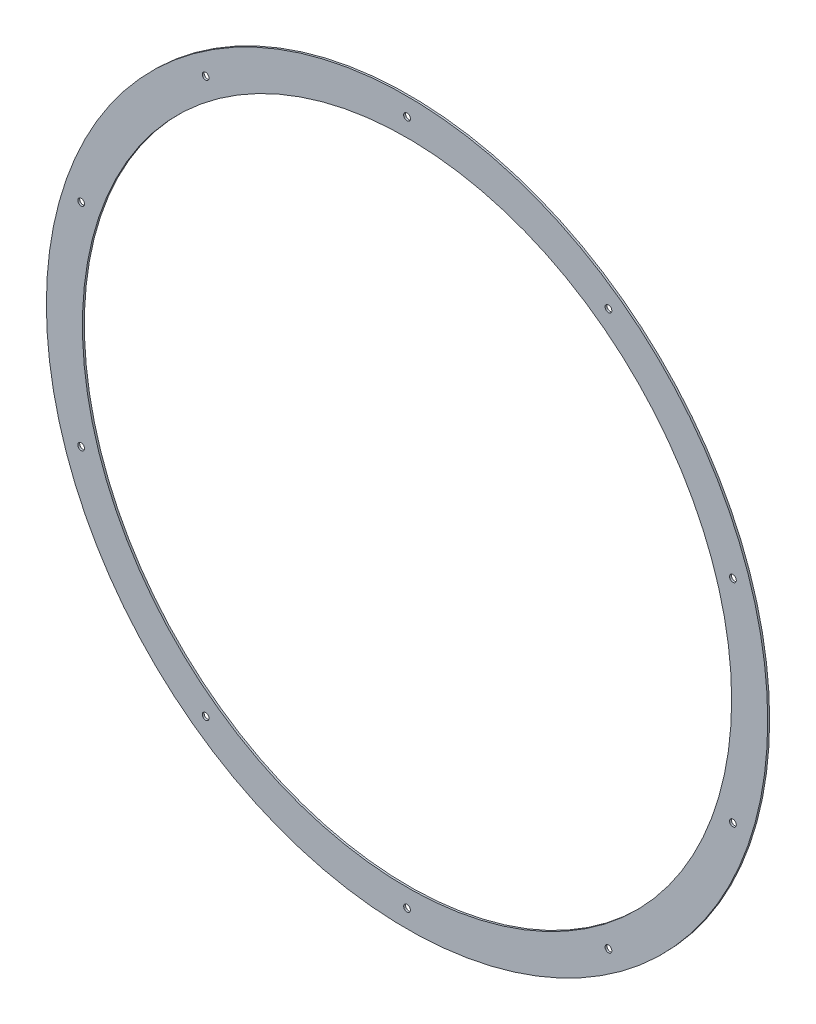
ISO-10303-21;
HEADER;
FILE_DESCRIPTION(('STEP AP214'),'2;1');
FILE_NAME('part.step','',(''),(''),'','','');
FILE_SCHEMA(('AUTOMOTIVE_DESIGN { 1 0 10303 214 1 1 1 1 }'));
ENDSEC;
DATA;
#1=APPLICATION_CONTEXT('core data for automotive mechanical design processes');
#2=APPLICATION_PROTOCOL_DEFINITION('international standard','automotive_design',2000,#1);
#3=PRODUCT_CONTEXT('',#1,'mechanical');
#4=PRODUCT('Part','Part','',(#3));
#5=PRODUCT_RELATED_PRODUCT_CATEGORY('part','',(#4));
#6=PRODUCT_DEFINITION_FORMATION('','',#4);
#7=PRODUCT_DEFINITION_CONTEXT('part definition',#1,'design');
#8=PRODUCT_DEFINITION('design','',#6,#7);
#9=PRODUCT_DEFINITION_SHAPE('','',#8);
#10=(LENGTH_UNIT() NAMED_UNIT(*) SI_UNIT(.MILLI.,.METRE.));
#11=(NAMED_UNIT(*) PLANE_ANGLE_UNIT() SI_UNIT($,.RADIAN.));
#12=(NAMED_UNIT(*) SI_UNIT($,.STERADIAN.) SOLID_ANGLE_UNIT());
#13=UNCERTAINTY_MEASURE_WITH_UNIT(LENGTH_MEASURE(1.E-05),#10,'distance_accuracy_value','');
#14=(GEOMETRIC_REPRESENTATION_CONTEXT(3) GLOBAL_UNCERTAINTY_ASSIGNED_CONTEXT((#13)) GLOBAL_UNIT_ASSIGNED_CONTEXT((#10,
#11,#12)) REPRESENTATION_CONTEXT('',''));
#15=CARTESIAN_POINT('',(0.,0.,0.));
#16=DIRECTION('',(0.,0.,1.));
#17=DIRECTION('',(1.,0.,0.));
#18=AXIS2_PLACEMENT_3D('',#15,#16,#17);
#19=CARTESIAN_POINT('',(0.,0.,2.032));
#20=DIRECTION('',(0.,0.,1.));
#21=DIRECTION('',(1.,0.,0.));
#22=AXIS2_PLACEMENT_3D('',#19,#20,#21);
#23=PLANE('',#22);
#24=CARTESIAN_POINT('',(-212.748872067257,-292.823701114015,2.032));
#25=DIRECTION('',(0.,0.,1.));
#26=DIRECTION('',(0.809016994374955,-0.587785252292462,0.));
#27=AXIS2_PLACEMENT_3D('',#24,#25,#26);
#28=CIRCLE('',#27,3.55599999999999);
#29=CARTESIAN_POINT('',(-209.872007635259,-294.913865471167,2.032));
#30=VERTEX_POINT('',#29);
#31=EDGE_CURVE('E106',#30,#30,#28,.T.);
#32=ORIENTED_EDGE('',*,*,#31,.F.);
#33=EDGE_LOOP('',(#32));
#34=FACE_BOUND('',#33,.T.);
#35=CARTESIAN_POINT('',(-344.23490607303,-111.848701114016,2.032));
#36=DIRECTION('',(0.,0.,1.));
#37=DIRECTION('',(0.309016994374958,-0.95105651629515,0.));
#38=AXIS2_PLACEMENT_3D('',#35,#36,#37);
#39=CIRCLE('',#38,3.55599999999999);
#40=CARTESIAN_POINT('',(-343.136041641032,-115.230658085962,2.032));
#41=VERTEX_POINT('',#40);
#42=EDGE_CURVE('E100',#41,#41,#39,.T.);
#43=ORIENTED_EDGE('',*,*,#42,.F.);
#44=EDGE_LOOP('',(#43));
#45=FACE_BOUND('',#44,.T.);
#46=CARTESIAN_POINT('',(-344.234906073032,111.848701114009,2.032));
#47=DIRECTION('',(0.,0.,1.));
#48=DIRECTION('',(-0.309016994374938,-0.951056516295157,0.));
#49=AXIS2_PLACEMENT_3D('',#46,#47,#48);
#50=CIRCLE('',#49,3.55599999999999);
#51=CARTESIAN_POINT('',(-345.333770505029,108.466744142063,2.032));
#52=VERTEX_POINT('',#51);
#53=EDGE_CURVE('E94',#52,#52,#50,.T.);
#54=ORIENTED_EDGE('',*,*,#53,.F.);
#55=EDGE_LOOP('',(#54));
#56=FACE_BOUND('',#55,.T.);
#57=CARTESIAN_POINT('',(-212.748872067263,292.82370111401,2.032));
#58=DIRECTION('',(0.,0.,1.));
#59=DIRECTION('',(-0.809016994374942,-0.58778525229248,0.));
#60=AXIS2_PLACEMENT_3D('',#57,#58,#59);
#61=CIRCLE('',#60,3.55599999999999);
#62=CARTESIAN_POINT('',(-215.625736499261,290.733536756858,2.032));
#63=VERTEX_POINT('',#62);
#64=EDGE_CURVE('E88',#63,#63,#61,.T.);
#65=ORIENTED_EDGE('',*,*,#64,.F.);
#66=EDGE_LOOP('',(#65));
#67=FACE_BOUND('',#66,.T.);
#68=CARTESIAN_POINT('',(-2.56766932748339E-12,361.95,2.032));
#69=DIRECTION('',(0.,0.,1.));
#70=DIRECTION('',(-1.,0.,0.));
#71=AXIS2_PLACEMENT_3D('',#68,#69,#70);
#72=CIRCLE('',#71,3.55599999999999);
#73=CARTESIAN_POINT('',(-3.55600000000256,361.95,2.032));
#74=VERTEX_POINT('',#73);
#75=EDGE_CURVE('E82',#74,#74,#72,.T.);
#76=ORIENTED_EDGE('',*,*,#75,.F.);
#77=EDGE_LOOP('',(#76));
#78=FACE_BOUND('',#77,.T.);
#79=CARTESIAN_POINT('',(212.748872067259,292.823701114013,2.032));
#80=DIRECTION('',(0.,0.,1.));
#81=DIRECTION('',(-0.809016994374951,0.587785252292469,0.));
#82=AXIS2_PLACEMENT_3D('',#79,#80,#81);
#83=CIRCLE('',#82,3.55599999999999);
#84=CARTESIAN_POINT('',(209.872007635262,294.913865471165,2.032));
#85=VERTEX_POINT('',#84);
#86=EDGE_CURVE('E76',#85,#85,#83,.T.);
#87=ORIENTED_EDGE('',*,*,#86,.F.);
#88=EDGE_LOOP('',(#87));
#89=FACE_BOUND('',#88,.T.);
#90=CARTESIAN_POINT('',(344.23490607303,111.848701114014,2.032));
#91=DIRECTION('',(0.,0.,1.));
#92=DIRECTION('',(-0.309016994374952,0.951056516295152,0.));
#93=AXIS2_PLACEMENT_3D('',#90,#91,#92);
#94=CIRCLE('',#93,3.55599999999999);
#95=CARTESIAN_POINT('',(343.136041641033,115.230658085959,2.032));
#96=VERTEX_POINT('',#95);
#97=EDGE_CURVE('E70',#96,#96,#94,.T.);
#98=ORIENTED_EDGE('',*,*,#97,.F.);
#99=EDGE_LOOP('',(#98));
#100=FACE_BOUND('',#99,.T.);
#101=CARTESIAN_POINT('',(344.234906073031,-111.848701114011,2.032));
#102=DIRECTION('',(0.,0.,1.));
#103=DIRECTION('',(0.309016994374945,0.951056516295155,0.));
#104=AXIS2_PLACEMENT_3D('',#101,#102,#103);
#105=CIRCLE('',#104,3.55599999999999);
#106=CARTESIAN_POINT('',(345.333770505028,-108.466744142066,2.032));
#107=VERTEX_POINT('',#106);
#108=EDGE_CURVE('E64',#107,#107,#105,.T.);
#109=ORIENTED_EDGE('',*,*,#108,.F.);
#110=EDGE_LOOP('',(#109));
#111=FACE_BOUND('',#110,.T.);
#112=CARTESIAN_POINT('',(212.748872067261,-292.823701114012,2.032));
#113=DIRECTION('',(0.,0.,1.));
#114=DIRECTION('',(0.809016994374947,0.587785252292474,0.));
#115=AXIS2_PLACEMENT_3D('',#112,#113,#114);
#116=CIRCLE('',#115,3.55599999999999);
#117=CARTESIAN_POINT('',(215.625736499258,-290.73353675686,2.032));
#118=VERTEX_POINT('',#117);
#119=EDGE_CURVE('E58',#118,#118,#116,.T.);
#120=ORIENTED_EDGE('',*,*,#119,.F.);
#121=EDGE_LOOP('',(#120));
#122=FACE_BOUND('',#121,.T.);
#123=CARTESIAN_POINT('',(0.,-361.95,2.032));
#124=DIRECTION('',(0.,0.,1.));
#125=DIRECTION('',(1.,0.,0.));
#126=AXIS2_PLACEMENT_3D('',#123,#124,#125);
#127=CIRCLE('',#126,3.55599999999999);
#128=CARTESIAN_POINT('',(3.55600000000003,-361.95,2.032));
#129=VERTEX_POINT('',#128);
#130=EDGE_CURVE('E52',#129,#129,#127,.T.);
#131=ORIENTED_EDGE('',*,*,#130,.F.);
#132=EDGE_LOOP('',(#131));
#133=FACE_BOUND('',#132,.T.);
#134=CARTESIAN_POINT('',(0.,0.,2.032));
#135=DIRECTION('',(0.,0.,1.));
#136=DIRECTION('',(1.,0.,0.));
#137=AXIS2_PLACEMENT_3D('',#134,#135,#136);
#138=CIRCLE('',#137,381.);
#139=CARTESIAN_POINT('',(381.,0.,2.032));
#140=VERTEX_POINT('',#139);
#141=EDGE_CURVE('E10',#140,#140,#138,.T.);
#142=ORIENTED_EDGE('',*,*,#141,.T.);
#143=EDGE_LOOP('',(#142));
#144=FACE_BOUND('',#143,.T.);
#145=CARTESIAN_POINT('',(0.,0.,2.032));
#146=DIRECTION('',(0.,0.,1.));
#147=DIRECTION('',(1.,0.,0.));
#148=AXIS2_PLACEMENT_3D('',#145,#146,#147);
#149=CIRCLE('',#148,342.9);
#150=CARTESIAN_POINT('',(342.9,0.,2.032));
#151=VERTEX_POINT('',#150);
#152=EDGE_CURVE('E40',#151,#151,#149,.T.);
#153=ORIENTED_EDGE('',*,*,#152,.F.);
#154=EDGE_LOOP('',(#153));
#155=FACE_BOUND('',#154,.T.);
#156=ADVANCED_FACE('F29',(#34,#45,#56,#67,#78,#89,#100,#111,#122,#133,#144,#155),#23,.T.);
#157=CARTESIAN_POINT('',(0.,0.,0.));
#158=DIRECTION('',(0.,0.,1.));
#159=DIRECTION('',(1.,0.,0.));
#160=AXIS2_PLACEMENT_3D('',#157,#158,#159);
#161=PLANE('',#160);
#162=CARTESIAN_POINT('',(-212.748872067257,-292.823701114015,0.));
#163=DIRECTION('',(0.,0.,1.));
#164=DIRECTION('',(1.,0.,0.));
#165=AXIS2_PLACEMENT_3D('',#162,#163,#164);
#166=CIRCLE('',#165,3.55599999999999);
#167=CARTESIAN_POINT('',(-209.192872067257,-292.823701114015,0.));
#168=VERTEX_POINT('',#167);
#169=EDGE_CURVE('E103',#168,#168,#166,.F.);
#170=ORIENTED_EDGE('',*,*,#169,.F.);
#171=EDGE_LOOP('',(#170));
#172=FACE_BOUND('',#171,.T.);
#173=CARTESIAN_POINT('',(-344.23490607303,-111.848701114016,0.));
#174=DIRECTION('',(0.,0.,1.));
#175=DIRECTION('',(1.,0.,0.));
#176=AXIS2_PLACEMENT_3D('',#173,#174,#175);
#177=CIRCLE('',#176,3.55599999999999);
#178=CARTESIAN_POINT('',(-340.67890607303,-111.848701114016,0.));
#179=VERTEX_POINT('',#178);
#180=EDGE_CURVE('E97',#179,#179,#177,.F.);
#181=ORIENTED_EDGE('',*,*,#180,.F.);
#182=EDGE_LOOP('',(#181));
#183=FACE_BOUND('',#182,.T.);
#184=CARTESIAN_POINT('',(-344.234906073032,111.848701114009,0.));
#185=DIRECTION('',(0.,0.,1.));
#186=DIRECTION('',(1.,0.,0.));
#187=AXIS2_PLACEMENT_3D('',#184,#185,#186);
#188=CIRCLE('',#187,3.55599999999999);
#189=CARTESIAN_POINT('',(-340.678906073032,111.848701114009,0.));
#190=VERTEX_POINT('',#189);
#191=EDGE_CURVE('E91',#190,#190,#188,.F.);
#192=ORIENTED_EDGE('',*,*,#191,.F.);
#193=EDGE_LOOP('',(#192));
#194=FACE_BOUND('',#193,.T.);
#195=CARTESIAN_POINT('',(-212.748872067263,292.82370111401,0.));
#196=DIRECTION('',(0.,0.,1.));
#197=DIRECTION('',(1.,0.,0.));
#198=AXIS2_PLACEMENT_3D('',#195,#196,#197);
#199=CIRCLE('',#198,3.55599999999999);
#200=CARTESIAN_POINT('',(-209.192872067263,292.82370111401,0.));
#201=VERTEX_POINT('',#200);
#202=EDGE_CURVE('E85',#201,#201,#199,.F.);
#203=ORIENTED_EDGE('',*,*,#202,.F.);
#204=EDGE_LOOP('',(#203));
#205=FACE_BOUND('',#204,.T.);
#206=CARTESIAN_POINT('',(-2.56766932748339E-12,361.95,0.));
#207=DIRECTION('',(0.,0.,1.));
#208=DIRECTION('',(1.,0.,0.));
#209=AXIS2_PLACEMENT_3D('',#206,#207,#208);
#210=CIRCLE('',#209,3.55599999999999);
#211=CARTESIAN_POINT('',(3.55599999999743,361.95,0.));
#212=VERTEX_POINT('',#211);
#213=EDGE_CURVE('E79',#212,#212,#210,.F.);
#214=ORIENTED_EDGE('',*,*,#213,.F.);
#215=EDGE_LOOP('',(#214));
#216=FACE_BOUND('',#215,.T.);
#217=CARTESIAN_POINT('',(212.748872067259,292.823701114013,0.));
#218=DIRECTION('',(0.,0.,1.));
#219=DIRECTION('',(1.,0.,0.));
#220=AXIS2_PLACEMENT_3D('',#217,#218,#219);
#221=CIRCLE('',#220,3.55599999999999);
#222=CARTESIAN_POINT('',(216.304872067259,292.823701114013,0.));
#223=VERTEX_POINT('',#222);
#224=EDGE_CURVE('E73',#223,#223,#221,.F.);
#225=ORIENTED_EDGE('',*,*,#224,.F.);
#226=EDGE_LOOP('',(#225));
#227=FACE_BOUND('',#226,.T.);
#228=CARTESIAN_POINT('',(344.23490607303,111.848701114014,0.));
#229=DIRECTION('',(0.,0.,1.));
#230=DIRECTION('',(1.,0.,0.));
#231=AXIS2_PLACEMENT_3D('',#228,#229,#230);
#232=CIRCLE('',#231,3.55599999999999);
#233=CARTESIAN_POINT('',(347.79090607303,111.848701114014,0.));
#234=VERTEX_POINT('',#233);
#235=EDGE_CURVE('E67',#234,#234,#232,.F.);
#236=ORIENTED_EDGE('',*,*,#235,.F.);
#237=EDGE_LOOP('',(#236));
#238=FACE_BOUND('',#237,.T.);
#239=CARTESIAN_POINT('',(344.234906073031,-111.848701114011,0.));
#240=DIRECTION('',(0.,0.,1.));
#241=DIRECTION('',(1.,0.,0.));
#242=AXIS2_PLACEMENT_3D('',#239,#240,#241);
#243=CIRCLE('',#242,3.55599999999999);
#244=CARTESIAN_POINT('',(347.790906073031,-111.848701114011,0.));
#245=VERTEX_POINT('',#244);
#246=EDGE_CURVE('E61',#245,#245,#243,.F.);
#247=ORIENTED_EDGE('',*,*,#246,.F.);
#248=EDGE_LOOP('',(#247));
#249=FACE_BOUND('',#248,.T.);
#250=CARTESIAN_POINT('',(212.748872067261,-292.823701114012,0.));
#251=DIRECTION('',(0.,0.,1.));
#252=DIRECTION('',(1.,0.,0.));
#253=AXIS2_PLACEMENT_3D('',#250,#251,#252);
#254=CIRCLE('',#253,3.55599999999999);
#255=CARTESIAN_POINT('',(216.304872067261,-292.823701114012,0.));
#256=VERTEX_POINT('',#255);
#257=EDGE_CURVE('E55',#256,#256,#254,.F.);
#258=ORIENTED_EDGE('',*,*,#257,.F.);
#259=EDGE_LOOP('',(#258));
#260=FACE_BOUND('',#259,.T.);
#261=CARTESIAN_POINT('',(0.,-361.95,0.));
#262=DIRECTION('',(0.,0.,1.));
#263=DIRECTION('',(1.,0.,0.));
#264=AXIS2_PLACEMENT_3D('',#261,#262,#263);
#265=CIRCLE('',#264,3.55599999999999);
#266=CARTESIAN_POINT('',(3.55600000000003,-361.95,0.));
#267=VERTEX_POINT('',#266);
#268=EDGE_CURVE('E49',#267,#267,#265,.F.);
#269=ORIENTED_EDGE('',*,*,#268,.F.);
#270=EDGE_LOOP('',(#269));
#271=FACE_BOUND('',#270,.T.);
#272=CARTESIAN_POINT('',(0.,0.,0.));
#273=DIRECTION('',(0.,0.,1.));
#274=DIRECTION('',(1.,0.,0.));
#275=AXIS2_PLACEMENT_3D('',#272,#273,#274);
#276=CIRCLE('',#275,381.);
#277=CARTESIAN_POINT('',(381.,0.,0.));
#278=VERTEX_POINT('',#277);
#279=EDGE_CURVE('E36',#278,#278,#276,.T.);
#280=ORIENTED_EDGE('',*,*,#279,.F.);
#281=EDGE_LOOP('',(#280));
#282=FACE_BOUND('',#281,.T.);
#283=CARTESIAN_POINT('',(0.,0.,0.));
#284=DIRECTION('',(0.,0.,1.));
#285=DIRECTION('',(1.,0.,0.));
#286=AXIS2_PLACEMENT_3D('',#283,#284,#285);
#287=CIRCLE('',#286,342.9);
#288=CARTESIAN_POINT('',(342.9,0.,0.));
#289=VERTEX_POINT('',#288);
#290=EDGE_CURVE('E44',#289,#289,#287,.T.);
#291=ORIENTED_EDGE('',*,*,#290,.T.);
#292=EDGE_LOOP('',(#291));
#293=FACE_BOUND('',#292,.T.);
#294=ADVANCED_FACE('F115',(#172,#183,#194,#205,#216,#227,#238,#249,#260,#271,#282,#293),#161,.F.);
#295=CARTESIAN_POINT('',(0.,0.,2.032));
#296=DIRECTION('',(0.,0.,-1.));
#297=DIRECTION('',(-1.,0.,0.));
#298=AXIS2_PLACEMENT_3D('',#295,#296,#297);
#299=CYLINDRICAL_SURFACE('',#298,381.);
#300=ORIENTED_EDGE('',*,*,#141,.F.);
#301=EDGE_LOOP('',(#300));
#302=FACE_BOUND('',#301,.T.);
#303=ORIENTED_EDGE('',*,*,#279,.T.);
#304=EDGE_LOOP('',(#303));
#305=FACE_BOUND('',#304,.T.);
#306=ADVANCED_FACE('F31',(#302,#305),#299,.T.);
#307=CARTESIAN_POINT('',(0.,0.,2.032));
#308=DIRECTION('',(0.,0.,-1.));
#309=DIRECTION('',(-1.,0.,0.));
#310=AXIS2_PLACEMENT_3D('',#307,#308,#309);
#311=CYLINDRICAL_SURFACE('',#310,342.9);
#312=ORIENTED_EDGE('',*,*,#152,.T.);
#313=EDGE_LOOP('',(#312));
#314=FACE_BOUND('',#313,.T.);
#315=ORIENTED_EDGE('',*,*,#290,.F.);
#316=EDGE_LOOP('',(#315));
#317=FACE_BOUND('',#316,.T.);
#318=ADVANCED_FACE('F136',(#314,#317),#311,.F.);
#319=CARTESIAN_POINT('',(0.,-361.95,-0.00100000000000013));
#320=DIRECTION('',(0.,0.,1.));
#321=DIRECTION('',(1.,0.,0.));
#322=AXIS2_PLACEMENT_3D('',#319,#320,#321);
#323=CYLINDRICAL_SURFACE('',#322,3.55599999999999);
#324=ORIENTED_EDGE('',*,*,#130,.T.);
#325=EDGE_LOOP('',(#324));
#326=FACE_BOUND('',#325,.T.);
#327=ORIENTED_EDGE('',*,*,#268,.T.);
#328=EDGE_LOOP('',(#327));
#329=FACE_BOUND('',#328,.T.);
#330=ADVANCED_FACE('F139',(#326,#329),#323,.F.);
#331=CARTESIAN_POINT('',(212.748872067261,-292.823701114012,-0.00100000000000013));
#332=DIRECTION('',(0.,0.,1.));
#333=DIRECTION('',(1.,0.,0.));
#334=AXIS2_PLACEMENT_3D('',#331,#332,#333);
#335=CYLINDRICAL_SURFACE('',#334,3.55599999999999);
#336=ORIENTED_EDGE('',*,*,#119,.T.);
#337=EDGE_LOOP('',(#336));
#338=FACE_BOUND('',#337,.T.);
#339=ORIENTED_EDGE('',*,*,#257,.T.);
#340=EDGE_LOOP('',(#339));
#341=FACE_BOUND('',#340,.T.);
#342=ADVANCED_FACE('F156',(#338,#341),#335,.F.);
#343=CARTESIAN_POINT('',(344.234906073031,-111.848701114011,-0.00100000000000013));
#344=DIRECTION('',(0.,0.,1.));
#345=DIRECTION('',(1.,0.,0.));
#346=AXIS2_PLACEMENT_3D('',#343,#344,#345);
#347=CYLINDRICAL_SURFACE('',#346,3.55599999999999);
#348=ORIENTED_EDGE('',*,*,#108,.T.);
#349=EDGE_LOOP('',(#348));
#350=FACE_BOUND('',#349,.T.);
#351=ORIENTED_EDGE('',*,*,#246,.T.);
#352=EDGE_LOOP('',(#351));
#353=FACE_BOUND('',#352,.T.);
#354=ADVANCED_FACE('F159',(#350,#353),#347,.F.);
#355=CARTESIAN_POINT('',(344.23490607303,111.848701114014,-0.00100000000000013));
#356=DIRECTION('',(0.,0.,1.));
#357=DIRECTION('',(1.,0.,0.));
#358=AXIS2_PLACEMENT_3D('',#355,#356,#357);
#359=CYLINDRICAL_SURFACE('',#358,3.55599999999999);
#360=ORIENTED_EDGE('',*,*,#97,.T.);
#361=EDGE_LOOP('',(#360));
#362=FACE_BOUND('',#361,.T.);
#363=ORIENTED_EDGE('',*,*,#235,.T.);
#364=EDGE_LOOP('',(#363));
#365=FACE_BOUND('',#364,.T.);
#366=ADVANCED_FACE('F163',(#362,#365),#359,.F.);
#367=CARTESIAN_POINT('',(212.748872067259,292.823701114013,-0.00100000000000013));
#368=DIRECTION('',(0.,0.,1.));
#369=DIRECTION('',(1.,0.,0.));
#370=AXIS2_PLACEMENT_3D('',#367,#368,#369);
#371=CYLINDRICAL_SURFACE('',#370,3.55599999999999);
#372=ORIENTED_EDGE('',*,*,#86,.T.);
#373=EDGE_LOOP('',(#372));
#374=FACE_BOUND('',#373,.T.);
#375=ORIENTED_EDGE('',*,*,#224,.T.);
#376=EDGE_LOOP('',(#375));
#377=FACE_BOUND('',#376,.T.);
#378=ADVANCED_FACE('F167',(#374,#377),#371,.F.);
#379=CARTESIAN_POINT('',(-2.56766932748339E-12,361.95,-0.00100000000000013));
#380=DIRECTION('',(0.,0.,1.));
#381=DIRECTION('',(1.,0.,0.));
#382=AXIS2_PLACEMENT_3D('',#379,#380,#381);
#383=CYLINDRICAL_SURFACE('',#382,3.55599999999999);
#384=ORIENTED_EDGE('',*,*,#75,.T.);
#385=EDGE_LOOP('',(#384));
#386=FACE_BOUND('',#385,.T.);
#387=ORIENTED_EDGE('',*,*,#213,.T.);
#388=EDGE_LOOP('',(#387));
#389=FACE_BOUND('',#388,.T.);
#390=ADVANCED_FACE('F171',(#386,#389),#383,.F.);
#391=CARTESIAN_POINT('',(-212.748872067263,292.82370111401,-0.00100000000000013));
#392=DIRECTION('',(0.,0.,1.));
#393=DIRECTION('',(1.,0.,0.));
#394=AXIS2_PLACEMENT_3D('',#391,#392,#393);
#395=CYLINDRICAL_SURFACE('',#394,3.55599999999999);
#396=ORIENTED_EDGE('',*,*,#64,.T.);
#397=EDGE_LOOP('',(#396));
#398=FACE_BOUND('',#397,.T.);
#399=ORIENTED_EDGE('',*,*,#202,.T.);
#400=EDGE_LOOP('',(#399));
#401=FACE_BOUND('',#400,.T.);
#402=ADVANCED_FACE('F175',(#398,#401),#395,.F.);
#403=CARTESIAN_POINT('',(-344.234906073032,111.848701114009,-0.00100000000000013));
#404=DIRECTION('',(0.,0.,1.));
#405=DIRECTION('',(1.,0.,0.));
#406=AXIS2_PLACEMENT_3D('',#403,#404,#405);
#407=CYLINDRICAL_SURFACE('',#406,3.55599999999999);
#408=ORIENTED_EDGE('',*,*,#53,.T.);
#409=EDGE_LOOP('',(#408));
#410=FACE_BOUND('',#409,.T.);
#411=ORIENTED_EDGE('',*,*,#191,.T.);
#412=EDGE_LOOP('',(#411));
#413=FACE_BOUND('',#412,.T.);
#414=ADVANCED_FACE('F179',(#410,#413),#407,.F.);
#415=CARTESIAN_POINT('',(-344.23490607303,-111.848701114016,-0.00100000000000013));
#416=DIRECTION('',(0.,0.,1.));
#417=DIRECTION('',(1.,0.,0.));
#418=AXIS2_PLACEMENT_3D('',#415,#416,#417);
#419=CYLINDRICAL_SURFACE('',#418,3.55599999999999);
#420=ORIENTED_EDGE('',*,*,#42,.T.);
#421=EDGE_LOOP('',(#420));
#422=FACE_BOUND('',#421,.T.);
#423=ORIENTED_EDGE('',*,*,#180,.T.);
#424=EDGE_LOOP('',(#423));
#425=FACE_BOUND('',#424,.T.);
#426=ADVANCED_FACE('F183',(#422,#425),#419,.F.);
#427=CARTESIAN_POINT('',(-212.748872067257,-292.823701114015,-0.00100000000000013));
#428=DIRECTION('',(0.,0.,1.));
#429=DIRECTION('',(1.,0.,0.));
#430=AXIS2_PLACEMENT_3D('',#427,#428,#429);
#431=CYLINDRICAL_SURFACE('',#430,3.55599999999999);
#432=ORIENTED_EDGE('',*,*,#31,.T.);
#433=EDGE_LOOP('',(#432));
#434=FACE_BOUND('',#433,.T.);
#435=ORIENTED_EDGE('',*,*,#169,.T.);
#436=EDGE_LOOP('',(#435));
#437=FACE_BOUND('',#436,.T.);
#438=ADVANCED_FACE('F110',(#434,#437),#431,.F.);
#439=CLOSED_SHELL('',(#156,#294,#306,#318,#330,#342,#354,#366,#378,#390,#402,#414,#426,#438));
#440=MANIFOLD_SOLID_BREP('B2',#439);
#441=ADVANCED_BREP_SHAPE_REPRESENTATION('',(#18,#440),#14);
#442=SHAPE_DEFINITION_REPRESENTATION(#9,#441);
ENDSEC;
END-ISO-10303-21;
